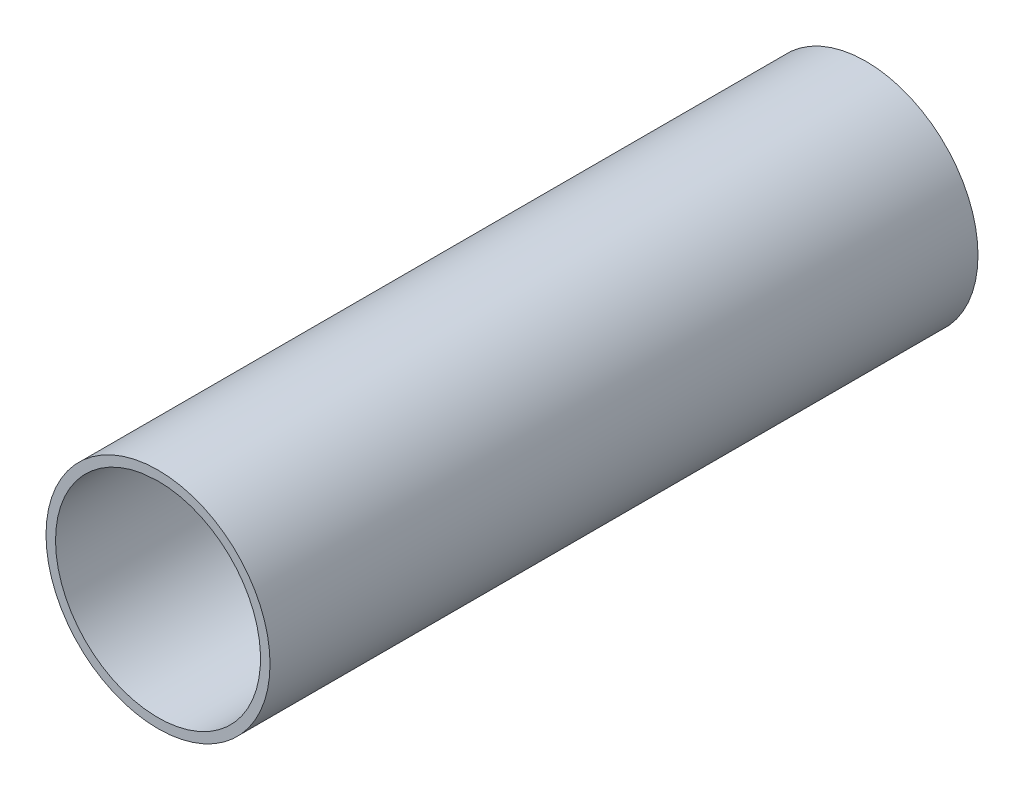
ISO-10303-21;
HEADER;
FILE_DESCRIPTION(('STEP AP214'),'2;1');
FILE_NAME('part.step','',(''),(''),'','','');
FILE_SCHEMA(('AUTOMOTIVE_DESIGN { 1 0 10303 214 1 1 1 1 }'));
ENDSEC;
DATA;
#1=APPLICATION_CONTEXT('core data for automotive mechanical design processes');
#2=APPLICATION_PROTOCOL_DEFINITION('international standard','automotive_design',2000,#1);
#3=PRODUCT_CONTEXT('',#1,'mechanical');
#4=PRODUCT('Part','Part','',(#3));
#5=PRODUCT_RELATED_PRODUCT_CATEGORY('part','',(#4));
#6=PRODUCT_DEFINITION_FORMATION('','',#4);
#7=PRODUCT_DEFINITION_CONTEXT('part definition',#1,'design');
#8=PRODUCT_DEFINITION('design','',#6,#7);
#9=PRODUCT_DEFINITION_SHAPE('','',#8);
#10=(LENGTH_UNIT() NAMED_UNIT(*) SI_UNIT(.MILLI.,.METRE.));
#11=(NAMED_UNIT(*) PLANE_ANGLE_UNIT() SI_UNIT($,.RADIAN.));
#12=(NAMED_UNIT(*) SI_UNIT($,.STERADIAN.) SOLID_ANGLE_UNIT());
#13=UNCERTAINTY_MEASURE_WITH_UNIT(LENGTH_MEASURE(1.E-05),#10,'distance_accuracy_value','');
#14=(GEOMETRIC_REPRESENTATION_CONTEXT(3) GLOBAL_UNCERTAINTY_ASSIGNED_CONTEXT((#13)) GLOBAL_UNIT_ASSIGNED_CONTEXT((#10,
#11,#12)) REPRESENTATION_CONTEXT('',''));
#15=CARTESIAN_POINT('',(0.,0.,0.));
#16=DIRECTION('',(0.,0.,1.));
#17=DIRECTION('',(1.,0.,0.));
#18=AXIS2_PLACEMENT_3D('',#15,#16,#17);
#19=CARTESIAN_POINT('',(0.,0.,0.));
#20=DIRECTION('',(0.,0.,-1.));
#21=DIRECTION('',(-1.,0.,0.));
#22=AXIS2_PLACEMENT_3D('',#19,#20,#21);
#23=PLANE('',#22);
#24=CARTESIAN_POINT('',(0.,0.,0.));
#25=DIRECTION('',(0.,0.,1.));
#26=DIRECTION('',(-1.,0.,0.));
#27=AXIS2_PLACEMENT_3D('',#24,#25,#26);
#28=CIRCLE('',#27,5.);
#29=CARTESIAN_POINT('',(-5.,0.,0.));
#30=VERTEX_POINT('',#29);
#31=CARTESIAN_POINT('',(5.,0.,0.));
#32=VERTEX_POINT('',#31);
#33=EDGE_CURVE('E102',#30,#32,#28,.T.);
#34=ORIENTED_EDGE('',*,*,#33,.F.);
#35=DIRECTION('',(0.,-1.,0.));
#36=VECTOR('',#35,1.);
#37=CARTESIAN_POINT('',(-5.,0.,0.));
#38=LINE('',#37,#36);
#39=CARTESIAN_POINT('',(-5.,16.5617028110035,0.));
#40=VERTEX_POINT('',#39);
#41=EDGE_CURVE('E56',#40,#30,#38,.T.);
#42=ORIENTED_EDGE('',*,*,#41,.F.);
#43=CARTESIAN_POINT('',(0.,0.,0.));
#44=DIRECTION('',(0.,0.,1.));
#45=DIRECTION('',(1.,0.,0.));
#46=AXIS2_PLACEMENT_3D('',#43,#44,#45);
#47=CIRCLE('',#46,17.3);
#48=CARTESIAN_POINT('',(5.,16.5617028110035,0.));
#49=VERTEX_POINT('',#48);
#50=EDGE_CURVE('E103',#49,#40,#47,.T.);
#51=ORIENTED_EDGE('',*,*,#50,.F.);
#52=DIRECTION('',(0.,1.,0.));
#53=VECTOR('',#52,1.);
#54=CARTESIAN_POINT('',(5.,0.,0.));
#55=LINE('',#54,#53);
#56=EDGE_CURVE('E92',#32,#49,#55,.T.);
#57=ORIENTED_EDGE('',*,*,#56,.F.);
#58=EDGE_LOOP('',(#34,#42,#51,#57));
#59=FACE_BOUND('',#58,.T.);
#60=CARTESIAN_POINT('',(0.,0.,0.));
#61=DIRECTION('',(0.,0.,1.));
#62=DIRECTION('',(1.,0.,0.));
#63=AXIS2_PLACEMENT_3D('',#60,#61,#62);
#64=CIRCLE('',#63,2.99999999999862);
#65=CARTESIAN_POINT('',(2.99999999999862,0.,0.));
#66=VERTEX_POINT('',#65);
#67=EDGE_CURVE('E115',#66,#66,#64,.T.);
#68=ORIENTED_EDGE('',*,*,#67,.T.);
#69=EDGE_LOOP('',(#68));
#70=FACE_BOUND('',#69,.T.);
#71=ADVANCED_FACE('F47',(#59,#70),#23,.T.);
#72=CARTESIAN_POINT('',(0.,0.,83.4395171801736));
#73=DIRECTION('',(0.,0.,-1.));
#74=DIRECTION('',(-1.,0.,0.));
#75=AXIS2_PLACEMENT_3D('',#72,#73,#74);
#76=CYLINDRICAL_SURFACE('',#75,5.);
#77=DIRECTION('',(0.,0.,-1.));
#78=VECTOR('',#77,1.);
#79=CARTESIAN_POINT('',(5.,0.,83.4395171801736));
#80=LINE('',#79,#78);
#81=CARTESIAN_POINT('',(5.,0.,58.6));
#82=VERTEX_POINT('',#81);
#83=EDGE_CURVE('E89',#82,#32,#80,.T.);
#84=ORIENTED_EDGE('',*,*,#83,.F.);
#85=CARTESIAN_POINT('',(0.,0.,58.6));
#86=DIRECTION('',(0.,0.,-1.));
#87=DIRECTION('',(-1.,0.,0.));
#88=AXIS2_PLACEMENT_3D('',#85,#86,#87);
#89=CIRCLE('',#88,5.);
#90=CARTESIAN_POINT('',(-5.,0.,58.6));
#91=VERTEX_POINT('',#90);
#92=EDGE_CURVE('E64',#82,#91,#89,.T.);
#93=ORIENTED_EDGE('',*,*,#92,.T.);
#94=DIRECTION('',(0.,0.,-1.));
#95=VECTOR('',#94,1.);
#96=CARTESIAN_POINT('',(-5.,0.,83.4395171801736));
#97=LINE('',#96,#95);
#98=EDGE_CURVE('E108',#91,#30,#97,.T.);
#99=ORIENTED_EDGE('',*,*,#98,.T.);
#100=ORIENTED_EDGE('',*,*,#33,.T.);
#101=EDGE_LOOP('',(#84,#93,#99,#100));
#102=FACE_BOUND('',#101,.T.);
#103=ADVANCED_FACE('F106',(#102),#76,.T.);
#104=CARTESIAN_POINT('',(5.,0.,83.4395171801736));
#105=DIRECTION('',(-1.,0.,0.));
#106=DIRECTION('',(0.,-1.,0.));
#107=AXIS2_PLACEMENT_3D('',#104,#105,#106);
#108=PLANE('',#107);
#109=DIRECTION('',(0.,0.,-1.));
#110=VECTOR('',#109,1.);
#111=CARTESIAN_POINT('',(5.,16.5617028110035,83.4395171801736));
#112=LINE('',#111,#110);
#113=CARTESIAN_POINT('',(5.,16.5617028110035,58.6));
#114=VERTEX_POINT('',#113);
#115=EDGE_CURVE('E84',#114,#49,#112,.T.);
#116=ORIENTED_EDGE('',*,*,#115,.F.);
#117=DIRECTION('',(0.,-1.,0.));
#118=VECTOR('',#117,1.);
#119=CARTESIAN_POINT('',(5.,0.,58.6));
#120=LINE('',#119,#118);
#121=EDGE_CURVE('E94',#114,#82,#120,.T.);
#122=ORIENTED_EDGE('',*,*,#121,.T.);
#123=ORIENTED_EDGE('',*,*,#83,.T.);
#124=ORIENTED_EDGE('',*,*,#56,.T.);
#125=EDGE_LOOP('',(#116,#122,#123,#124));
#126=FACE_BOUND('',#125,.T.);
#127=ADVANCED_FACE('F91',(#126),#108,.F.);
#128=CARTESIAN_POINT('',(0.,0.,83.4395171801736));
#129=DIRECTION('',(0.,0.,-1.));
#130=DIRECTION('',(-1.,0.,0.));
#131=AXIS2_PLACEMENT_3D('',#128,#129,#130);
#132=CYLINDRICAL_SURFACE('',#131,17.3);
#133=DIRECTION('',(0.,0.,-1.));
#134=VECTOR('',#133,1.);
#135=CARTESIAN_POINT('',(-5.,16.5617028110035,83.4395171801736));
#136=LINE('',#135,#134);
#137=CARTESIAN_POINT('',(-5.,16.5617028110035,58.6));
#138=VERTEX_POINT('',#137);
#139=EDGE_CURVE('E119',#138,#40,#136,.T.);
#140=ORIENTED_EDGE('',*,*,#139,.F.);
#141=CARTESIAN_POINT('',(0.,0.,58.6));
#142=DIRECTION('',(0.,0.,-1.));
#143=DIRECTION('',(-1.,0.,0.));
#144=AXIS2_PLACEMENT_3D('',#141,#142,#143);
#145=CIRCLE('',#144,17.3);
#146=EDGE_CURVE('E104',#138,#114,#145,.T.);
#147=ORIENTED_EDGE('',*,*,#146,.T.);
#148=ORIENTED_EDGE('',*,*,#115,.T.);
#149=ORIENTED_EDGE('',*,*,#50,.T.);
#150=EDGE_LOOP('',(#140,#147,#148,#149));
#151=FACE_BOUND('',#150,.T.);
#152=ADVANCED_FACE('F128',(#151),#132,.T.);
#153=CARTESIAN_POINT('',(-5.,0.,83.4395171801736));
#154=DIRECTION('',(1.,0.,0.));
#155=DIRECTION('',(0.,1.,0.));
#156=AXIS2_PLACEMENT_3D('',#153,#154,#155);
#157=PLANE('',#156);
#158=ORIENTED_EDGE('',*,*,#98,.F.);
#159=DIRECTION('',(0.,1.,0.));
#160=VECTOR('',#159,1.);
#161=CARTESIAN_POINT('',(-5.,0.,58.6));
#162=LINE('',#161,#160);
#163=EDGE_CURVE('E120',#91,#138,#162,.T.);
#164=ORIENTED_EDGE('',*,*,#163,.T.);
#165=ORIENTED_EDGE('',*,*,#139,.T.);
#166=ORIENTED_EDGE('',*,*,#41,.T.);
#167=EDGE_LOOP('',(#158,#164,#165,#166));
#168=FACE_BOUND('',#167,.T.);
#169=ADVANCED_FACE('F127',(#168),#157,.F.);
#170=CARTESIAN_POINT('',(0.,0.,83.4395171801736));
#171=DIRECTION('',(0.,0.,-1.));
#172=DIRECTION('',(-1.,0.,0.));
#173=AXIS2_PLACEMENT_3D('',#170,#171,#172);
#174=CYLINDRICAL_SURFACE('',#173,2.99999999999862);
#175=CARTESIAN_POINT('',(0.,0.,58.6));
#176=DIRECTION('',(0.,0.,-1.));
#177=DIRECTION('',(-1.,0.,0.));
#178=AXIS2_PLACEMENT_3D('',#175,#176,#177);
#179=CIRCLE('',#178,2.99999999999862);
#180=CARTESIAN_POINT('',(-2.99999999999862,0.,58.6));
#181=VERTEX_POINT('',#180);
#182=EDGE_CURVE('E13',#181,#181,#179,.T.);
#183=ORIENTED_EDGE('',*,*,#182,.F.);
#184=EDGE_LOOP('',(#183));
#185=FACE_BOUND('',#184,.T.);
#186=ORIENTED_EDGE('',*,*,#67,.F.);
#187=EDGE_LOOP('',(#186));
#188=FACE_BOUND('',#187,.T.);
#189=ADVANCED_FACE('F130',(#185,#188),#174,.F.);
#190=CARTESIAN_POINT('',(0.,0.,58.6));
#191=DIRECTION('',(0.,0.,-1.));
#192=DIRECTION('',(-1.,0.,0.));
#193=AXIS2_PLACEMENT_3D('',#190,#191,#192);
#194=PLANE('',#193);
#195=ORIENTED_EDGE('',*,*,#182,.T.);
#196=EDGE_LOOP('',(#195));
#197=FACE_BOUND('',#196,.T.);
#198=ORIENTED_EDGE('',*,*,#121,.F.);
#199=ORIENTED_EDGE('',*,*,#146,.F.);
#200=ORIENTED_EDGE('',*,*,#163,.F.);
#201=ORIENTED_EDGE('',*,*,#92,.F.);
#202=EDGE_LOOP('',(#198,#199,#200,#201));
#203=FACE_BOUND('',#202,.T.);
#204=ADVANCED_FACE('F49',(#197,#203),#194,.F.);
#205=CLOSED_SHELL('',(#71,#103,#127,#152,#169,#189,#204));
#206=MANIFOLD_SOLID_BREP('B2',#205);
#207=CARTESIAN_POINT('',(-7.42569141893252,8.1153624041562,126.4));
#208=DIRECTION('',(0.,0.,-1.));
#209=DIRECTION('',(-1.,0.,0.));
#210=AXIS2_PLACEMENT_3D('',#207,#208,#209);
#211=CYLINDRICAL_SURFACE('',#210,6.);
#212=CARTESIAN_POINT('',(-7.42569141893252,8.1153624041562,67.4));
#213=DIRECTION('',(0.,0.,-1.));
#214=DIRECTION('',(-1.,0.,0.));
#215=AXIS2_PLACEMENT_3D('',#212,#213,#214);
#216=CIRCLE('',#215,6.);
#217=CARTESIAN_POINT('',(-1.50631490724211,9.09565915149749,67.4));
#218=VERTEX_POINT('',#217);
#219=CARTESIAN_POINT('',(-3.37531428133296,3.68880109279827,67.4));
#220=VERTEX_POINT('',#219);
#221=EDGE_CURVE('E355',#218,#220,#216,.T.);
#222=ORIENTED_EDGE('',*,*,#221,.F.);
#223=DIRECTION('',(0.,0.,-1.));
#224=VECTOR('',#223,1.);
#225=CARTESIAN_POINT('',(-1.50631490724211,9.09565915149749,126.4));
#226=LINE('',#225,#224);
#227=CARTESIAN_POINT('',(-1.50631490724211,9.09565915149749,59.));
#228=VERTEX_POINT('',#227);
#229=EDGE_CURVE('E210',#218,#228,#226,.T.);
#230=ORIENTED_EDGE('',*,*,#229,.T.);
#231=CARTESIAN_POINT('',(-7.42569141893252,8.1153624041562,59.));
#232=DIRECTION('',(0.,0.,-1.));
#233=DIRECTION('',(-1.,0.,0.));
#234=AXIS2_PLACEMENT_3D('',#231,#232,#233);
#235=CIRCLE('',#234,6.);
#236=CARTESIAN_POINT('',(-3.37531428133296,3.68880109279827,59.));
#237=VERTEX_POINT('',#236);
#238=EDGE_CURVE('E333',#228,#237,#235,.T.);
#239=ORIENTED_EDGE('',*,*,#238,.T.);
#240=DIRECTION('',(0.,0.,-1.));
#241=VECTOR('',#240,1.);
#242=CARTESIAN_POINT('',(-3.37531428133296,3.68880109279827,126.4));
#243=LINE('',#242,#241);
#244=EDGE_CURVE('E306',#220,#237,#243,.T.);
#245=ORIENTED_EDGE('',*,*,#244,.F.);
#246=EDGE_LOOP('',(#222,#230,#239,#245));
#247=FACE_BOUND('',#246,.T.);
#248=ADVANCED_FACE('F193',(#247),#211,.F.);
#249=CARTESIAN_POINT('',(0.,0.,126.4));
#250=DIRECTION('',(0.,0.,-1.));
#251=DIRECTION('',(-1.,0.,0.));
#252=AXIS2_PLACEMENT_3D('',#249,#250,#251);
#253=CYLINDRICAL_SURFACE('',#252,5.);
#254=CARTESIAN_POINT('',(0.,0.,67.4));
#255=DIRECTION('',(0.,0.,-1.));
#256=DIRECTION('',(-1.,0.,0.));
#257=AXIS2_PLACEMENT_3D('',#254,#255,#256);
#258=CIRCLE('',#257,5.);
#259=CARTESIAN_POINT('',(2.72727272727273,4.19070202604222,67.4));
#260=VERTEX_POINT('',#259);
#261=EDGE_CURVE('E354',#220,#260,#258,.F.);
#262=ORIENTED_EDGE('',*,*,#261,.F.);
#263=ORIENTED_EDGE('',*,*,#244,.T.);
#264=CARTESIAN_POINT('',(0.,0.,59.));
#265=DIRECTION('',(0.,0.,-1.));
#266=DIRECTION('',(-1.,0.,0.));
#267=AXIS2_PLACEMENT_3D('',#264,#265,#266);
#268=CIRCLE('',#267,5.);
#269=CARTESIAN_POINT('',(2.72727272727273,4.19070202604222,59.));
#270=VERTEX_POINT('',#269);
#271=EDGE_CURVE('E335',#237,#270,#268,.F.);
#272=ORIENTED_EDGE('',*,*,#271,.T.);
#273=DIRECTION('',(0.,0.,-1.));
#274=VECTOR('',#273,1.);
#275=CARTESIAN_POINT('',(2.72727272727273,4.19070202604222,126.4));
#276=LINE('',#275,#274);
#277=EDGE_CURVE('E296',#260,#270,#276,.T.);
#278=ORIENTED_EDGE('',*,*,#277,.F.);
#279=EDGE_LOOP('',(#262,#263,#272,#278));
#280=FACE_BOUND('',#279,.T.);
#281=ADVANCED_FACE('F352',(#280),#253,.T.);
#282=CARTESIAN_POINT('',(6.,9.21954445729289,126.4));
#283=DIRECTION('',(0.,0.,-1.));
#284=DIRECTION('',(-1.,0.,0.));
#285=AXIS2_PLACEMENT_3D('',#282,#283,#284);
#286=CYLINDRICAL_SURFACE('',#285,6.);
#287=CARTESIAN_POINT('',(6.,9.21954445729289,67.4));
#288=DIRECTION('',(0.,0.,-1.));
#289=DIRECTION('',(-1.,0.,0.));
#290=AXIS2_PLACEMENT_3D('',#287,#288,#289);
#291=CIRCLE('',#290,6.);
#292=CARTESIAN_POINT('',(0.,9.21954445729289,67.4));
#293=VERTEX_POINT('',#292);
#294=EDGE_CURVE('E269',#260,#293,#291,.T.);
#295=ORIENTED_EDGE('',*,*,#294,.F.);
#296=ORIENTED_EDGE('',*,*,#277,.T.);
#297=CARTESIAN_POINT('',(6.,9.21954445729289,59.));
#298=DIRECTION('',(0.,0.,-1.));
#299=DIRECTION('',(-1.,0.,0.));
#300=AXIS2_PLACEMENT_3D('',#297,#298,#299);
#301=CIRCLE('',#300,6.);
#302=CARTESIAN_POINT('',(0.,9.21954445729289,59.));
#303=VERTEX_POINT('',#302);
#304=EDGE_CURVE('E338',#270,#303,#301,.T.);
#305=ORIENTED_EDGE('',*,*,#304,.T.);
#306=DIRECTION('',(0.,0.,-1.));
#307=VECTOR('',#306,1.);
#308=CARTESIAN_POINT('',(0.,9.21954445729289,126.4));
#309=LINE('',#308,#307);
#310=EDGE_CURVE('E295',#293,#303,#309,.T.);
#311=ORIENTED_EDGE('',*,*,#310,.F.);
#312=EDGE_LOOP('',(#295,#296,#305,#311));
#313=FACE_BOUND('',#312,.T.);
#314=ADVANCED_FACE('F345',(#313),#286,.F.);
#315=CARTESIAN_POINT('',(0.,18.3,126.4));
#316=DIRECTION('',(1.,0.,0.));
#317=DIRECTION('',(0.,1.,0.));
#318=AXIS2_PLACEMENT_3D('',#315,#316,#317);
#319=PLANE('',#318);
#320=DIRECTION('',(0.,1.,0.));
#321=VECTOR('',#320,1.);
#322=CARTESIAN_POINT('',(0.,18.3,67.4));
#323=LINE('',#322,#321);
#324=CARTESIAN_POINT('',(0.,18.3,67.4));
#325=VERTEX_POINT('',#324);
#326=EDGE_CURVE('E262',#293,#325,#323,.T.);
#327=ORIENTED_EDGE('',*,*,#326,.F.);
#328=ORIENTED_EDGE('',*,*,#310,.T.);
#329=DIRECTION('',(0.,1.,0.));
#330=VECTOR('',#329,1.);
#331=CARTESIAN_POINT('',(0.,18.3,59.));
#332=LINE('',#331,#330);
#333=CARTESIAN_POINT('',(0.,18.3,59.));
#334=VERTEX_POINT('',#333);
#335=EDGE_CURVE('E285',#303,#334,#332,.T.);
#336=ORIENTED_EDGE('',*,*,#335,.T.);
#337=DIRECTION('',(0.,0.,-1.));
#338=VECTOR('',#337,1.);
#339=CARTESIAN_POINT('',(0.,18.3,126.4));
#340=LINE('',#339,#338);
#341=EDGE_CURVE('E282',#325,#334,#340,.T.);
#342=ORIENTED_EDGE('',*,*,#341,.F.);
#343=EDGE_LOOP('',(#327,#328,#336,#342));
#344=FACE_BOUND('',#343,.T.);
#345=ADVANCED_FACE('F283',(#344),#319,.T.);
#346=CARTESIAN_POINT('',(-2.98990507939095,18.0540983606557,126.4));
#347=DIRECTION('',(-0.986562751948401,-0.163382791223549,0.));
#348=DIRECTION('',(0.163382791223549,-0.986562751948401,0.));
#349=AXIS2_PLACEMENT_3D('',#346,#347,#348);
#350=PLANE('',#349);
#351=DIRECTION('',(0.163382791223549,-0.986562751948401,0.));
#352=VECTOR('',#351,1.);
#353=CARTESIAN_POINT('',(-2.98990507939095,18.0540983606557,67.4));
#354=LINE('',#353,#352);
#355=CARTESIAN_POINT('',(-2.98990507939095,18.0540983606557,67.4));
#356=VERTEX_POINT('',#355);
#357=EDGE_CURVE('E359',#356,#218,#354,.T.);
#358=ORIENTED_EDGE('',*,*,#357,.F.);
#359=DIRECTION('',(0.,0.,-1.));
#360=VECTOR('',#359,1.);
#361=CARTESIAN_POINT('',(-2.98990507939095,18.0540983606557,126.4));
#362=LINE('',#361,#360);
#363=CARTESIAN_POINT('',(-2.98990507939095,18.0540983606557,59.));
#364=VERTEX_POINT('',#363);
#365=EDGE_CURVE('E301',#356,#364,#362,.T.);
#366=ORIENTED_EDGE('',*,*,#365,.T.);
#367=DIRECTION('',(0.163382791223549,-0.986562751948401,0.));
#368=VECTOR('',#367,1.);
#369=CARTESIAN_POINT('',(-2.98990507939095,18.0540983606557,59.));
#370=LINE('',#369,#368);
#371=EDGE_CURVE('E325',#364,#228,#370,.T.);
#372=ORIENTED_EDGE('',*,*,#371,.T.);
#373=ORIENTED_EDGE('',*,*,#229,.F.);
#374=EDGE_LOOP('',(#358,#366,#372,#373));
#375=FACE_BOUND('',#374,.T.);
#376=ADVANCED_FACE('F358',(#375),#350,.T.);
#377=CARTESIAN_POINT('',(0.,0.,126.4));
#378=DIRECTION('',(0.,0.,-1.));
#379=DIRECTION('',(-1.,0.,0.));
#380=AXIS2_PLACEMENT_3D('',#377,#378,#379);
#381=CYLINDRICAL_SURFACE('',#380,3.);
#382=CARTESIAN_POINT('',(0.,0.,67.4));
#383=DIRECTION('',(0.,0.,-1.));
#384=DIRECTION('',(-1.,0.,0.));
#385=AXIS2_PLACEMENT_3D('',#382,#383,#384);
#386=CIRCLE('',#385,3.);
#387=CARTESIAN_POINT('',(-3.,0.,67.4));
#388=VERTEX_POINT('',#387);
#389=EDGE_CURVE('E279',#388,#388,#386,.F.);
#390=ORIENTED_EDGE('',*,*,#389,.T.);
#391=EDGE_LOOP('',(#390));
#392=FACE_BOUND('',#391,.T.);
#393=CARTESIAN_POINT('',(0.,0.,59.));
#394=DIRECTION('',(0.,0.,-1.));
#395=DIRECTION('',(-1.,0.,0.));
#396=AXIS2_PLACEMENT_3D('',#393,#394,#395);
#397=CIRCLE('',#396,3.);
#398=CARTESIAN_POINT('',(-3.,0.,59.));
#399=VERTEX_POINT('',#398);
#400=EDGE_CURVE('E197',#399,#399,#397,.F.);
#401=ORIENTED_EDGE('',*,*,#400,.F.);
#402=EDGE_LOOP('',(#401));
#403=FACE_BOUND('',#402,.T.);
#404=ADVANCED_FACE('F391',(#392,#403),#381,.F.);
#405=CARTESIAN_POINT('',(0.,0.,126.4));
#406=DIRECTION('',(0.,0.,1.));
#407=DIRECTION('',(1.,0.,0.));
#408=AXIS2_PLACEMENT_3D('',#405,#406,#407);
#409=PLANE('',#408);
#410=DIRECTION('',(-0.99663502646365,-0.0819672131147538,0.));
#411=VECTOR('',#410,1.);
#412=CARTESIAN_POINT('',(0.,18.3,126.4));
#413=LINE('',#412,#411);
#414=CARTESIAN_POINT('',(0.,18.3,126.4));
#415=VERTEX_POINT('',#414);
#416=CARTESIAN_POINT('',(-2.98990507939095,18.0540983606557,126.4));
#417=VERTEX_POINT('',#416);
#418=EDGE_CURVE('E218',#415,#417,#413,.T.);
#419=ORIENTED_EDGE('',*,*,#418,.F.);
#420=CARTESIAN_POINT('',(0.,0.,126.4));
#421=DIRECTION('',(0.,0.,1.));
#422=DIRECTION('',(1.,0.,0.));
#423=AXIS2_PLACEMENT_3D('',#420,#421,#422);
#424=CIRCLE('',#423,18.3);
#425=EDGE_CURVE('E294',#417,#415,#424,.T.);
#426=ORIENTED_EDGE('',*,*,#425,.F.);
#427=EDGE_LOOP('',(#419,#426));
#428=FACE_BOUND('',#427,.T.);
#429=CARTESIAN_POINT('',(0.,0.,126.4));
#430=DIRECTION('',(0.,0.,1.));
#431=DIRECTION('',(1.,0.,0.));
#432=AXIS2_PLACEMENT_3D('',#429,#430,#431);
#433=CIRCLE('',#432,20.);
#434=CARTESIAN_POINT('',(20.,0.,126.4));
#435=VERTEX_POINT('',#434);
#436=EDGE_CURVE('E45',#435,#435,#433,.T.);
#437=ORIENTED_EDGE('',*,*,#436,.T.);
#438=EDGE_LOOP('',(#437));
#439=FACE_BOUND('',#438,.T.);
#440=ADVANCED_FACE('F314',(#428,#439),#409,.T.);
#441=CARTESIAN_POINT('',(0.,0.,0.));
#442=DIRECTION('',(0.,0.,1.));
#443=DIRECTION('',(1.,0.,0.));
#444=AXIS2_PLACEMENT_3D('',#441,#442,#443);
#445=PLANE('',#444);
#446=CARTESIAN_POINT('',(0.,0.,0.));
#447=DIRECTION('',(0.,0.,1.));
#448=DIRECTION('',(1.,0.,0.));
#449=AXIS2_PLACEMENT_3D('',#446,#447,#448);
#450=CIRCLE('',#449,20.);
#451=CARTESIAN_POINT('',(20.,0.,0.));
#452=VERTEX_POINT('',#451);
#453=EDGE_CURVE('E202',#452,#452,#450,.T.);
#454=ORIENTED_EDGE('',*,*,#453,.F.);
#455=EDGE_LOOP('',(#454));
#456=FACE_BOUND('',#455,.T.);
#457=CARTESIAN_POINT('',(0.,0.,0.));
#458=DIRECTION('',(0.,0.,1.));
#459=DIRECTION('',(1.,0.,0.));
#460=AXIS2_PLACEMENT_3D('',#457,#458,#459);
#461=CIRCLE('',#460,18.3);
#462=CARTESIAN_POINT('',(-2.98990507939095,18.0540983606557,0.));
#463=VERTEX_POINT('',#462);
#464=CARTESIAN_POINT('',(0.,18.3,0.));
#465=VERTEX_POINT('',#464);
#466=EDGE_CURVE('E304',#463,#465,#461,.T.);
#467=ORIENTED_EDGE('',*,*,#466,.T.);
#468=DIRECTION('',(0.99663502646365,0.0819672131147538,0.));
#469=VECTOR('',#468,1.);
#470=CARTESIAN_POINT('',(0.,18.3,0.));
#471=LINE('',#470,#469);
#472=EDGE_CURVE('E273',#463,#465,#471,.T.);
#473=ORIENTED_EDGE('',*,*,#472,.F.);
#474=EDGE_LOOP('',(#467,#473));
#475=FACE_BOUND('',#474,.T.);
#476=ADVANCED_FACE('F311',(#456,#475),#445,.F.);
#477=CARTESIAN_POINT('',(0.,0.,126.4));
#478=DIRECTION('',(0.,0.,-1.));
#479=DIRECTION('',(-1.,0.,0.));
#480=AXIS2_PLACEMENT_3D('',#477,#478,#479);
#481=CYLINDRICAL_SURFACE('',#480,20.);
#482=ORIENTED_EDGE('',*,*,#436,.F.);
#483=EDGE_LOOP('',(#482));
#484=FACE_BOUND('',#483,.T.);
#485=ORIENTED_EDGE('',*,*,#453,.T.);
#486=EDGE_LOOP('',(#485));
#487=FACE_BOUND('',#486,.T.);
#488=ADVANCED_FACE('F195',(#484,#487),#481,.T.);
#489=CARTESIAN_POINT('',(0.,0.,126.4));
#490=DIRECTION('',(0.,0.,-1.));
#491=DIRECTION('',(-1.,0.,0.));
#492=AXIS2_PLACEMENT_3D('',#489,#490,#491);
#493=CYLINDRICAL_SURFACE('',#492,18.3);
#494=ORIENTED_EDGE('',*,*,#365,.F.);
#495=EDGE_CURVE('E278',#417,#356,#362,.T.);
#496=ORIENTED_EDGE('',*,*,#495,.F.);
#497=ORIENTED_EDGE('',*,*,#425,.T.);
#498=EDGE_CURVE('E277',#415,#325,#340,.T.);
#499=ORIENTED_EDGE('',*,*,#498,.T.);
#500=ORIENTED_EDGE('',*,*,#341,.T.);
#501=DIRECTION('',(0.,0.,-1.));
#502=VECTOR('',#501,1.);
#503=CARTESIAN_POINT('',(0.,18.3,59.));
#504=LINE('',#503,#502);
#505=EDGE_CURVE('E319',#334,#465,#504,.T.);
#506=ORIENTED_EDGE('',*,*,#505,.T.);
#507=ORIENTED_EDGE('',*,*,#466,.F.);
#508=DIRECTION('',(0.,0.,-1.));
#509=VECTOR('',#508,1.);
#510=CARTESIAN_POINT('',(-2.98990507939095,18.0540983606557,59.));
#511=LINE('',#510,#509);
#512=EDGE_CURVE('E318',#364,#463,#511,.T.);
#513=ORIENTED_EDGE('',*,*,#512,.F.);
#514=EDGE_LOOP('',(#494,#496,#497,#499,#500,#506,#507,#513));
#515=FACE_BOUND('',#514,.T.);
#516=ADVANCED_FACE('F292',(#515),#493,.F.);
#517=CARTESIAN_POINT('',(0.,0.,59.));
#518=DIRECTION('',(0.,0.,-1.));
#519=DIRECTION('',(-1.,0.,0.));
#520=AXIS2_PLACEMENT_3D('',#517,#518,#519);
#521=PLANE('',#520);
#522=ORIENTED_EDGE('',*,*,#304,.F.);
#523=ORIENTED_EDGE('',*,*,#271,.F.);
#524=ORIENTED_EDGE('',*,*,#238,.F.);
#525=ORIENTED_EDGE('',*,*,#371,.F.);
#526=DIRECTION('',(0.99663502646365,0.0819672131147538,0.));
#527=VECTOR('',#526,1.);
#528=CARTESIAN_POINT('',(0.,18.3,59.));
#529=LINE('',#528,#527);
#530=EDGE_CURVE('E326',#364,#334,#529,.T.);
#531=ORIENTED_EDGE('',*,*,#530,.T.);
#532=ORIENTED_EDGE('',*,*,#335,.F.);
#533=EDGE_LOOP('',(#522,#523,#524,#525,#531,#532));
#534=FACE_BOUND('',#533,.T.);
#535=ORIENTED_EDGE('',*,*,#400,.T.);
#536=EDGE_LOOP('',(#535));
#537=FACE_BOUND('',#536,.T.);
#538=ADVANCED_FACE('F350',(#534,#537),#521,.T.);
#539=CARTESIAN_POINT('',(0.,18.3,59.));
#540=DIRECTION('',(-0.0819672131147538,0.99663502646365,0.));
#541=DIRECTION('',(-0.99663502646365,-0.0819672131147538,0.));
#542=AXIS2_PLACEMENT_3D('',#539,#540,#541);
#543=PLANE('',#542);
#544=ORIENTED_EDGE('',*,*,#472,.T.);
#545=ORIENTED_EDGE('',*,*,#505,.F.);
#546=ORIENTED_EDGE('',*,*,#530,.F.);
#547=ORIENTED_EDGE('',*,*,#512,.T.);
#548=EDGE_LOOP('',(#544,#545,#546,#547));
#549=FACE_BOUND('',#548,.T.);
#550=ADVANCED_FACE('F369',(#549),#543,.F.);
#551=CARTESIAN_POINT('',(0.,0.,67.4));
#552=DIRECTION('',(0.,0.,-1.));
#553=DIRECTION('',(-1.,0.,0.));
#554=AXIS2_PLACEMENT_3D('',#551,#552,#553);
#555=PLANE('',#554);
#556=ORIENTED_EDGE('',*,*,#326,.T.);
#557=DIRECTION('',(-0.99663502646365,-0.0819672131147538,0.));
#558=VECTOR('',#557,1.);
#559=CARTESIAN_POINT('',(0.,18.3,67.4));
#560=LINE('',#559,#558);
#561=EDGE_CURVE('E266',#325,#356,#560,.T.);
#562=ORIENTED_EDGE('',*,*,#561,.T.);
#563=ORIENTED_EDGE('',*,*,#357,.T.);
#564=ORIENTED_EDGE('',*,*,#221,.T.);
#565=ORIENTED_EDGE('',*,*,#261,.T.);
#566=ORIENTED_EDGE('',*,*,#294,.T.);
#567=EDGE_LOOP('',(#556,#562,#563,#564,#565,#566));
#568=FACE_BOUND('',#567,.T.);
#569=ORIENTED_EDGE('',*,*,#389,.F.);
#570=EDGE_LOOP('',(#569));
#571=FACE_BOUND('',#570,.T.);
#572=ADVANCED_FACE('F264',(#568,#571),#555,.F.);
#573=CARTESIAN_POINT('',(0.,18.3,67.4));
#574=DIRECTION('',(-0.0819672131147538,0.99663502646365,0.));
#575=DIRECTION('',(-0.99663502646365,-0.0819672131147538,0.));
#576=AXIS2_PLACEMENT_3D('',#573,#574,#575);
#577=PLANE('',#576);
#578=ORIENTED_EDGE('',*,*,#418,.T.);
#579=ORIENTED_EDGE('',*,*,#495,.T.);
#580=ORIENTED_EDGE('',*,*,#561,.F.);
#581=ORIENTED_EDGE('',*,*,#498,.F.);
#582=EDGE_LOOP('',(#578,#579,#580,#581));
#583=FACE_BOUND('',#582,.T.);
#584=ADVANCED_FACE('F275',(#583),#577,.F.);
#585=CLOSED_SHELL('',(#248,#281,#314,#345,#376,#404,#440,#476,#488,#516,#538,#550,#572,#584));
#586=MANIFOLD_SOLID_BREP('B7',#585);
#587=ADVANCED_BREP_SHAPE_REPRESENTATION('',(#18,#206,#586),#14);
#588=SHAPE_DEFINITION_REPRESENTATION(#9,#587);
ENDSEC;
END-ISO-10303-21;
